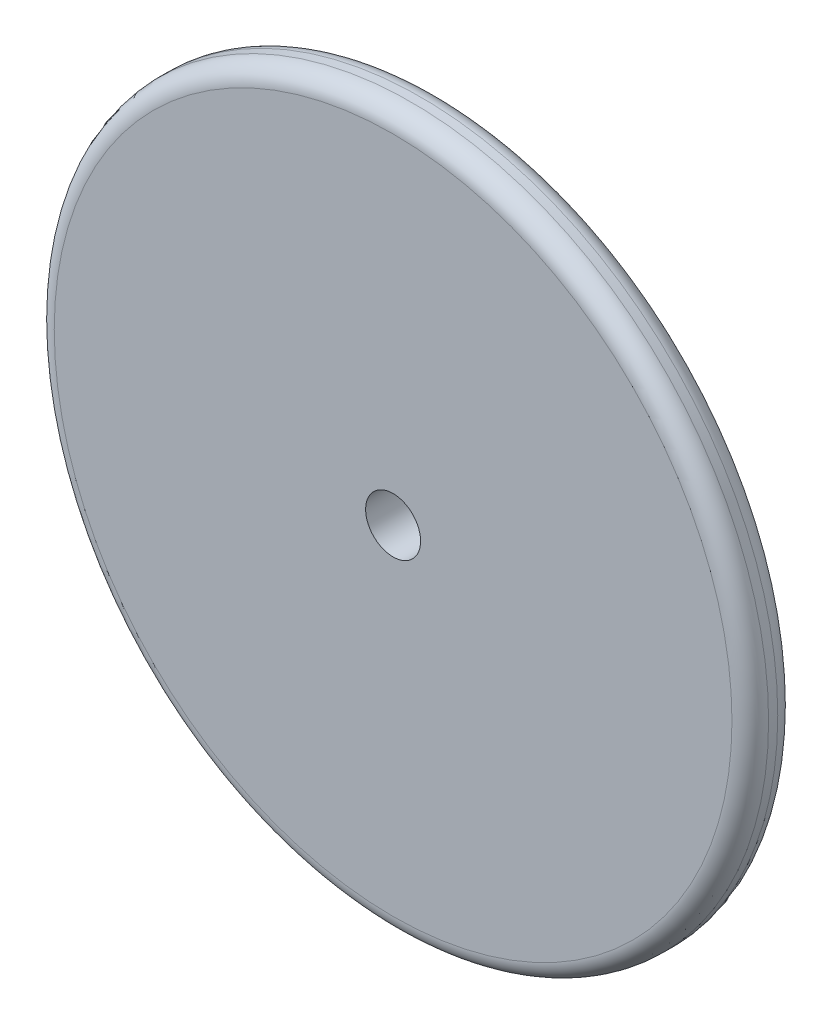
ISO-10303-21;
HEADER;
FILE_DESCRIPTION(('STEP AP214'),'2;1');
FILE_NAME('part.step','',(''),(''),'','','');
FILE_SCHEMA(('AUTOMOTIVE_DESIGN { 1 0 10303 214 1 1 1 1 }'));
ENDSEC;
DATA;
#1=APPLICATION_CONTEXT('core data for automotive mechanical design processes');
#2=APPLICATION_PROTOCOL_DEFINITION('international standard','automotive_design',2000,#1);
#3=PRODUCT_CONTEXT('',#1,'mechanical');
#4=PRODUCT('Part','Part','',(#3));
#5=PRODUCT_RELATED_PRODUCT_CATEGORY('part','',(#4));
#6=PRODUCT_DEFINITION_FORMATION('','',#4);
#7=PRODUCT_DEFINITION_CONTEXT('part definition',#1,'design');
#8=PRODUCT_DEFINITION('design','',#6,#7);
#9=PRODUCT_DEFINITION_SHAPE('','',#8);
#10=(LENGTH_UNIT() NAMED_UNIT(*) SI_UNIT(.MILLI.,.METRE.));
#11=(NAMED_UNIT(*) PLANE_ANGLE_UNIT() SI_UNIT($,.RADIAN.));
#12=(NAMED_UNIT(*) SI_UNIT($,.STERADIAN.) SOLID_ANGLE_UNIT());
#13=UNCERTAINTY_MEASURE_WITH_UNIT(LENGTH_MEASURE(1.E-05),#10,'distance_accuracy_value','');
#14=(GEOMETRIC_REPRESENTATION_CONTEXT(3) GLOBAL_UNCERTAINTY_ASSIGNED_CONTEXT((#13)) GLOBAL_UNIT_ASSIGNED_CONTEXT((#10,
#11,#12)) REPRESENTATION_CONTEXT('',''));
#15=CARTESIAN_POINT('',(0.,0.,0.));
#16=DIRECTION('',(0.,0.,1.));
#17=DIRECTION('',(1.,0.,0.));
#18=AXIS2_PLACEMENT_3D('',#15,#16,#17);
#19=CARTESIAN_POINT('',(0.,0.,5.));
#20=DIRECTION('',(0.,0.,1.));
#21=DIRECTION('',(1.,0.,0.));
#22=AXIS2_PLACEMENT_3D('',#19,#20,#21);
#23=PLANE('',#22);
#24=CARTESIAN_POINT('',(0.,0.,5.));
#25=DIRECTION('',(0.,0.,1.));
#26=DIRECTION('',(1.,0.,0.));
#27=AXIS2_PLACEMENT_3D('',#24,#25,#26);
#28=CIRCLE('',#27,37.);
#29=CARTESIAN_POINT('',(37.,0.,5.));
#30=VERTEX_POINT('',#29);
#31=EDGE_CURVE('E10',#30,#30,#28,.T.);
#32=ORIENTED_EDGE('',*,*,#31,.T.);
#33=EDGE_LOOP('',(#32));
#34=FACE_BOUND('',#33,.T.);
#35=CARTESIAN_POINT('',(0.,0.,5.));
#36=DIRECTION('',(0.,0.,1.));
#37=DIRECTION('',(1.,0.,0.));
#38=AXIS2_PLACEMENT_3D('',#35,#36,#37);
#39=CIRCLE('',#38,3.);
#40=CARTESIAN_POINT('',(3.,0.,5.));
#41=VERTEX_POINT('',#40);
#42=EDGE_CURVE('E50',#41,#41,#39,.T.);
#43=ORIENTED_EDGE('',*,*,#42,.F.);
#44=EDGE_LOOP('',(#43));
#45=FACE_BOUND('',#44,.T.);
#46=ADVANCED_FACE('F30',(#34,#45),#23,.T.);
#47=CARTESIAN_POINT('',(0.,0.,0.));
#48=DIRECTION('',(0.,0.,1.));
#49=DIRECTION('',(1.,0.,0.));
#50=AXIS2_PLACEMENT_3D('',#47,#48,#49);
#51=PLANE('',#50);
#52=CARTESIAN_POINT('',(0.,0.,0.));
#53=DIRECTION('',(0.,0.,1.));
#54=DIRECTION('',(1.,0.,0.));
#55=AXIS2_PLACEMENT_3D('',#52,#53,#54);
#56=CIRCLE('',#55,37.);
#57=CARTESIAN_POINT('',(37.,0.,0.));
#58=VERTEX_POINT('',#57);
#59=EDGE_CURVE('E37',#58,#58,#56,.F.);
#60=ORIENTED_EDGE('',*,*,#59,.T.);
#61=EDGE_LOOP('',(#60));
#62=FACE_BOUND('',#61,.T.);
#63=CARTESIAN_POINT('',(0.,0.,0.));
#64=DIRECTION('',(0.,0.,1.));
#65=DIRECTION('',(1.,0.,0.));
#66=AXIS2_PLACEMENT_3D('',#63,#64,#65);
#67=CIRCLE('',#66,3.);
#68=CARTESIAN_POINT('',(3.,0.,0.));
#69=VERTEX_POINT('',#68);
#70=EDGE_CURVE('E51',#69,#69,#67,.T.);
#71=ORIENTED_EDGE('',*,*,#70,.T.);
#72=EDGE_LOOP('',(#71));
#73=FACE_BOUND('',#72,.T.);
#74=ADVANCED_FACE('F61',(#62,#73),#51,.F.);
#75=CARTESIAN_POINT('',(0.,0.,5.));
#76=DIRECTION('',(0.,0.,-1.));
#77=DIRECTION('',(-1.,0.,0.));
#78=AXIS2_PLACEMENT_3D('',#75,#76,#77);
#79=CYLINDRICAL_SURFACE('',#78,39.);
#80=CARTESIAN_POINT('',(0.,0.,2.));
#81=DIRECTION('',(0.,0.,1.));
#82=DIRECTION('',(1.,0.,0.));
#83=AXIS2_PLACEMENT_3D('',#80,#81,#82);
#84=CIRCLE('',#83,39.);
#85=CARTESIAN_POINT('',(39.,0.,2.));
#86=VERTEX_POINT('',#85);
#87=EDGE_CURVE('E41',#86,#86,#84,.T.);
#88=ORIENTED_EDGE('',*,*,#87,.T.);
#89=EDGE_LOOP('',(#88));
#90=FACE_BOUND('',#89,.T.);
#91=CARTESIAN_POINT('',(0.,0.,3.));
#92=DIRECTION('',(0.,0.,1.));
#93=DIRECTION('',(1.,0.,0.));
#94=AXIS2_PLACEMENT_3D('',#91,#92,#93);
#95=CIRCLE('',#94,39.);
#96=CARTESIAN_POINT('',(39.,0.,3.));
#97=VERTEX_POINT('',#96);
#98=EDGE_CURVE('E45',#97,#97,#95,.F.);
#99=ORIENTED_EDGE('',*,*,#98,.T.);
#100=EDGE_LOOP('',(#99));
#101=FACE_BOUND('',#100,.T.);
#102=ADVANCED_FACE('F66',(#90,#101),#79,.T.);
#103=CARTESIAN_POINT('',(0.,0.,5.));
#104=DIRECTION('',(0.,0.,-1.));
#105=DIRECTION('',(-1.,0.,0.));
#106=AXIS2_PLACEMENT_3D('',#103,#104,#105);
#107=CYLINDRICAL_SURFACE('',#106,3.);
#108=ORIENTED_EDGE('',*,*,#42,.T.);
#109=EDGE_LOOP('',(#108));
#110=FACE_BOUND('',#109,.T.);
#111=ORIENTED_EDGE('',*,*,#70,.F.);
#112=EDGE_LOOP('',(#111));
#113=FACE_BOUND('',#112,.T.);
#114=ADVANCED_FACE('F57',(#110,#113),#107,.F.);
#115=CARTESIAN_POINT('',(0.,0.,2.));
#116=DIRECTION('',(0.,0.,1.));
#117=DIRECTION('',(1.,0.,0.));
#118=AXIS2_PLACEMENT_3D('',#115,#116,#117);
#119=TOROIDAL_SURFACE('',#118,37.,2.);
#120=ORIENTED_EDGE('',*,*,#59,.F.);
#121=EDGE_LOOP('',(#120));
#122=FACE_BOUND('',#121,.T.);
#123=ORIENTED_EDGE('',*,*,#87,.F.);
#124=EDGE_LOOP('',(#123));
#125=FACE_BOUND('',#124,.T.);
#126=ADVANCED_FACE('F72',(#122,#125),#119,.T.);
#127=CARTESIAN_POINT('',(0.,0.,3.));
#128=DIRECTION('',(0.,0.,1.));
#129=DIRECTION('',(1.,0.,0.));
#130=AXIS2_PLACEMENT_3D('',#127,#128,#129);
#131=TOROIDAL_SURFACE('',#130,37.,2.);
#132=ORIENTED_EDGE('',*,*,#98,.F.);
#133=EDGE_LOOP('',(#132));
#134=FACE_BOUND('',#133,.T.);
#135=ORIENTED_EDGE('',*,*,#31,.F.);
#136=EDGE_LOOP('',(#135));
#137=FACE_BOUND('',#136,.T.);
#138=ADVANCED_FACE('F32',(#134,#137),#131,.T.);
#139=CLOSED_SHELL('',(#46,#74,#102,#114,#126,#138));
#140=MANIFOLD_SOLID_BREP('B2',#139);
#141=ADVANCED_BREP_SHAPE_REPRESENTATION('',(#18,#140),#14);
#142=SHAPE_DEFINITION_REPRESENTATION(#9,#141);
ENDSEC;
END-ISO-10303-21;
